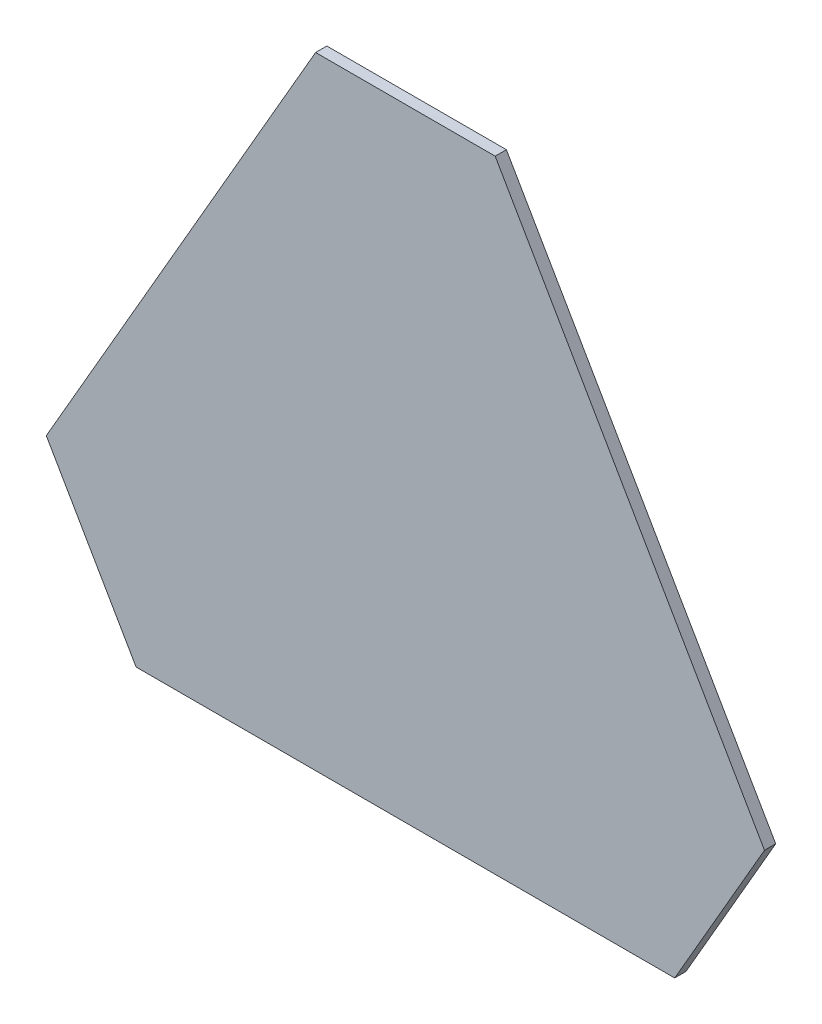
ISO-10303-21;
HEADER;
FILE_DESCRIPTION(('STEP AP214'),'2;1');
FILE_NAME('part.step','',(''),(''),'','','');
FILE_SCHEMA(('AUTOMOTIVE_DESIGN { 1 0 10303 214 1 1 1 1 }'));
ENDSEC;
DATA;
#1=APPLICATION_CONTEXT('core data for automotive mechanical design processes');
#2=APPLICATION_PROTOCOL_DEFINITION('international standard','automotive_design',2000,#1);
#3=PRODUCT_CONTEXT('',#1,'mechanical');
#4=PRODUCT('Part','Part','',(#3));
#5=PRODUCT_RELATED_PRODUCT_CATEGORY('part','',(#4));
#6=PRODUCT_DEFINITION_FORMATION('','',#4);
#7=PRODUCT_DEFINITION_CONTEXT('part definition',#1,'design');
#8=PRODUCT_DEFINITION('design','',#6,#7);
#9=PRODUCT_DEFINITION_SHAPE('','',#8);
#10=(LENGTH_UNIT() NAMED_UNIT(*) SI_UNIT(.MILLI.,.METRE.));
#11=(NAMED_UNIT(*) PLANE_ANGLE_UNIT() SI_UNIT($,.RADIAN.));
#12=(NAMED_UNIT(*) SI_UNIT($,.STERADIAN.) SOLID_ANGLE_UNIT());
#13=UNCERTAINTY_MEASURE_WITH_UNIT(LENGTH_MEASURE(1.E-05),#10,'distance_accuracy_value','');
#14=(GEOMETRIC_REPRESENTATION_CONTEXT(3) GLOBAL_UNCERTAINTY_ASSIGNED_CONTEXT((#13)) GLOBAL_UNIT_ASSIGNED_CONTEXT((#10,
#11,#12)) REPRESENTATION_CONTEXT('',''));
#15=CARTESIAN_POINT('',(0.,0.,0.));
#16=DIRECTION('',(0.,0.,1.));
#17=DIRECTION('',(1.,0.,0.));
#18=AXIS2_PLACEMENT_3D('',#15,#16,#17);
#19=CARTESIAN_POINT('',(-40.,69.2820323027551,5.));
#20=DIRECTION('',(0.866025403784439,0.5,0.));
#21=DIRECTION('',(-0.5,0.866025403784439,0.));
#22=AXIS2_PLACEMENT_3D('',#19,#20,#21);
#23=PLANE('',#22);
#24=DIRECTION('',(0.5,-0.866025403784439,0.));
#25=VECTOR('',#24,1.);
#26=CARTESIAN_POINT('',(-40.,69.2820323027551,0.));
#27=LINE('',#26,#25);
#28=CARTESIAN_POINT('',(-40.,69.2820323027551,0.));
#29=VERTEX_POINT('',#28);
#30=CARTESIAN_POINT('',(0.,0.,0.));
#31=VERTEX_POINT('',#30);
#32=EDGE_CURVE('E130',#29,#31,#27,.T.);
#33=ORIENTED_EDGE('',*,*,#32,.T.);
#34=DIRECTION('',(0.,0.,-1.));
#35=VECTOR('',#34,1.);
#36=CARTESIAN_POINT('',(0.,0.,5.));
#37=LINE('',#36,#35);
#38=CARTESIAN_POINT('',(0.,0.,5.));
#39=VERTEX_POINT('',#38);
#40=EDGE_CURVE('E11',#39,#31,#37,.T.);
#41=ORIENTED_EDGE('',*,*,#40,.F.);
#42=DIRECTION('',(0.5,-0.866025403784439,0.));
#43=VECTOR('',#42,1.);
#44=CARTESIAN_POINT('',(-40.,69.2820323027551,5.));
#45=LINE('',#44,#43);
#46=CARTESIAN_POINT('',(-40.,69.2820323027551,5.));
#47=VERTEX_POINT('',#46);
#48=EDGE_CURVE('E146',#47,#39,#45,.T.);
#49=ORIENTED_EDGE('',*,*,#48,.F.);
#50=DIRECTION('',(0.,0.,-1.));
#51=VECTOR('',#50,1.);
#52=CARTESIAN_POINT('',(-40.,69.2820323027551,5.));
#53=LINE('',#52,#51);
#54=EDGE_CURVE('E126',#47,#29,#53,.T.);
#55=ORIENTED_EDGE('',*,*,#54,.T.);
#56=EDGE_LOOP('',(#33,#41,#49,#55));
#57=FACE_BOUND('',#56,.T.);
#58=ADVANCED_FACE('F40',(#57),#23,.F.);
#59=CARTESIAN_POINT('',(0.,0.,5.));
#60=DIRECTION('',(0.,1.,0.));
#61=DIRECTION('',(0.,0.,1.));
#62=AXIS2_PLACEMENT_3D('',#59,#60,#61);
#63=PLANE('',#62);
#64=DIRECTION('',(1.,0.,0.));
#65=VECTOR('',#64,1.);
#66=CARTESIAN_POINT('',(0.,0.,0.));
#67=LINE('',#66,#65);
#68=CARTESIAN_POINT('',(240.,0.,0.));
#69=VERTEX_POINT('',#68);
#70=EDGE_CURVE('E134',#31,#69,#67,.T.);
#71=ORIENTED_EDGE('',*,*,#70,.T.);
#72=DIRECTION('',(0.,0.,-1.));
#73=VECTOR('',#72,1.);
#74=CARTESIAN_POINT('',(240.,0.,5.));
#75=LINE('',#74,#73);
#76=CARTESIAN_POINT('',(240.,0.,5.));
#77=VERTEX_POINT('',#76);
#78=EDGE_CURVE('E49',#77,#69,#75,.T.);
#79=ORIENTED_EDGE('',*,*,#78,.F.);
#80=DIRECTION('',(1.,0.,0.));
#81=VECTOR('',#80,1.);
#82=CARTESIAN_POINT('',(0.,0.,5.));
#83=LINE('',#82,#81);
#84=EDGE_CURVE('E94',#39,#77,#83,.T.);
#85=ORIENTED_EDGE('',*,*,#84,.F.);
#86=ORIENTED_EDGE('',*,*,#40,.T.);
#87=EDGE_LOOP('',(#71,#79,#85,#86));
#88=FACE_BOUND('',#87,.T.);
#89=ADVANCED_FACE('F175',(#88),#63,.F.);
#90=CARTESIAN_POINT('',(240.,0.,5.));
#91=DIRECTION('',(-0.866025403784438,0.500000000000001,0.));
#92=DIRECTION('',(-0.500000000000001,-0.866025403784438,0.));
#93=AXIS2_PLACEMENT_3D('',#90,#91,#92);
#94=PLANE('',#93);
#95=DIRECTION('',(0.500000000000001,0.866025403784438,0.));
#96=VECTOR('',#95,1.);
#97=CARTESIAN_POINT('',(240.,0.,0.));
#98=LINE('',#97,#96);
#99=CARTESIAN_POINT('',(280.,69.282032302755,0.));
#100=VERTEX_POINT('',#99);
#101=EDGE_CURVE('E137',#69,#100,#98,.T.);
#102=ORIENTED_EDGE('',*,*,#101,.T.);
#103=DIRECTION('',(0.,0.,-1.));
#104=VECTOR('',#103,1.);
#105=CARTESIAN_POINT('',(280.,69.282032302755,5.));
#106=LINE('',#105,#104);
#107=CARTESIAN_POINT('',(280.,69.282032302755,5.));
#108=VERTEX_POINT('',#107);
#109=EDGE_CURVE('E118',#108,#100,#106,.T.);
#110=ORIENTED_EDGE('',*,*,#109,.F.);
#111=DIRECTION('',(0.500000000000001,0.866025403784438,0.));
#112=VECTOR('',#111,1.);
#113=CARTESIAN_POINT('',(240.,0.,5.));
#114=LINE('',#113,#112);
#115=EDGE_CURVE('E107',#77,#108,#114,.T.);
#116=ORIENTED_EDGE('',*,*,#115,.F.);
#117=ORIENTED_EDGE('',*,*,#78,.T.);
#118=EDGE_LOOP('',(#102,#110,#116,#117));
#119=FACE_BOUND('',#118,.T.);
#120=ADVANCED_FACE('F157',(#119),#94,.F.);
#121=CARTESIAN_POINT('',(280.,69.282032302755,5.));
#122=DIRECTION('',(-0.866025403784439,-0.5,0.));
#123=DIRECTION('',(0.5,-0.866025403784439,0.));
#124=AXIS2_PLACEMENT_3D('',#121,#122,#123);
#125=PLANE('',#124);
#126=DIRECTION('',(-0.5,0.866025403784439,0.));
#127=VECTOR('',#126,1.);
#128=CARTESIAN_POINT('',(280.,69.282032302755,0.));
#129=LINE('',#128,#127);
#130=CARTESIAN_POINT('',(160.,277.12812921102,0.));
#131=VERTEX_POINT('',#130);
#132=EDGE_CURVE('E116',#100,#131,#129,.T.);
#133=ORIENTED_EDGE('',*,*,#132,.T.);
#134=DIRECTION('',(0.,0.,-1.));
#135=VECTOR('',#134,1.);
#136=CARTESIAN_POINT('',(160.,277.12812921102,5.));
#137=LINE('',#136,#135);
#138=CARTESIAN_POINT('',(160.,277.12812921102,5.));
#139=VERTEX_POINT('',#138);
#140=EDGE_CURVE('E113',#139,#131,#137,.T.);
#141=ORIENTED_EDGE('',*,*,#140,.F.);
#142=DIRECTION('',(-0.5,0.866025403784439,0.));
#143=VECTOR('',#142,1.);
#144=CARTESIAN_POINT('',(280.,69.282032302755,5.));
#145=LINE('',#144,#143);
#146=EDGE_CURVE('E101',#108,#139,#145,.T.);
#147=ORIENTED_EDGE('',*,*,#146,.F.);
#148=ORIENTED_EDGE('',*,*,#109,.T.);
#149=EDGE_LOOP('',(#133,#141,#147,#148));
#150=FACE_BOUND('',#149,.T.);
#151=ADVANCED_FACE('F114',(#150),#125,.F.);
#152=CARTESIAN_POINT('',(160.,277.12812921102,5.));
#153=DIRECTION('',(0.,-1.,0.));
#154=DIRECTION('',(1.,0.,0.));
#155=AXIS2_PLACEMENT_3D('',#152,#153,#154);
#156=PLANE('',#155);
#157=DIRECTION('',(-1.,0.,0.));
#158=VECTOR('',#157,1.);
#159=CARTESIAN_POINT('',(160.,277.12812921102,0.));
#160=LINE('',#159,#158);
#161=CARTESIAN_POINT('',(80.0000000000001,277.12812921102,0.));
#162=VERTEX_POINT('',#161);
#163=EDGE_CURVE('E80',#131,#162,#160,.T.);
#164=ORIENTED_EDGE('',*,*,#163,.T.);
#165=DIRECTION('',(0.,0.,-1.));
#166=VECTOR('',#165,1.);
#167=CARTESIAN_POINT('',(80.0000000000001,277.12812921102,5.));
#168=LINE('',#167,#166);
#169=CARTESIAN_POINT('',(80.0000000000001,277.12812921102,5.));
#170=VERTEX_POINT('',#169);
#171=EDGE_CURVE('E119',#170,#162,#168,.T.);
#172=ORIENTED_EDGE('',*,*,#171,.F.);
#173=DIRECTION('',(-1.,0.,0.));
#174=VECTOR('',#173,1.);
#175=CARTESIAN_POINT('',(160.,277.12812921102,5.));
#176=LINE('',#175,#174);
#177=EDGE_CURVE('E105',#139,#170,#176,.T.);
#178=ORIENTED_EDGE('',*,*,#177,.F.);
#179=ORIENTED_EDGE('',*,*,#140,.T.);
#180=EDGE_LOOP('',(#164,#172,#178,#179));
#181=FACE_BOUND('',#180,.T.);
#182=ADVANCED_FACE('F121',(#181),#156,.F.);
#183=CARTESIAN_POINT('',(80.0000000000001,277.12812921102,5.));
#184=DIRECTION('',(0.866025403784438,-0.500000000000001,0.));
#185=DIRECTION('',(0.500000000000001,0.866025403784438,0.));
#186=AXIS2_PLACEMENT_3D('',#183,#184,#185);
#187=PLANE('',#186);
#188=DIRECTION('',(-0.500000000000001,-0.866025403784438,0.));
#189=VECTOR('',#188,1.);
#190=CARTESIAN_POINT('',(80.0000000000001,277.12812921102,0.));
#191=LINE('',#190,#189);
#192=EDGE_CURVE('E86',#162,#29,#191,.T.);
#193=ORIENTED_EDGE('',*,*,#192,.T.);
#194=ORIENTED_EDGE('',*,*,#54,.F.);
#195=DIRECTION('',(-0.500000000000001,-0.866025403784438,0.));
#196=VECTOR('',#195,1.);
#197=CARTESIAN_POINT('',(80.0000000000001,277.12812921102,5.));
#198=LINE('',#197,#196);
#199=EDGE_CURVE('E57',#170,#47,#198,.T.);
#200=ORIENTED_EDGE('',*,*,#199,.F.);
#201=ORIENTED_EDGE('',*,*,#171,.T.);
#202=EDGE_LOOP('',(#193,#194,#200,#201));
#203=FACE_BOUND('',#202,.T.);
#204=ADVANCED_FACE('F164',(#203),#187,.F.);
#205=CARTESIAN_POINT('',(0.,0.,5.));
#206=DIRECTION('',(0.,0.,1.));
#207=DIRECTION('',(1.,0.,0.));
#208=AXIS2_PLACEMENT_3D('',#205,#206,#207);
#209=PLANE('',#208);
#210=ORIENTED_EDGE('',*,*,#48,.T.);
#211=ORIENTED_EDGE('',*,*,#84,.T.);
#212=ORIENTED_EDGE('',*,*,#115,.T.);
#213=ORIENTED_EDGE('',*,*,#146,.T.);
#214=ORIENTED_EDGE('',*,*,#177,.T.);
#215=ORIENTED_EDGE('',*,*,#199,.T.);
#216=EDGE_LOOP('',(#210,#211,#212,#213,#214,#215));
#217=FACE_BOUND('',#216,.T.);
#218=ADVANCED_FACE('F103',(#217),#209,.T.);
#219=CARTESIAN_POINT('',(0.,0.,0.));
#220=DIRECTION('',(0.,0.,1.));
#221=DIRECTION('',(1.,0.,0.));
#222=AXIS2_PLACEMENT_3D('',#219,#220,#221);
#223=PLANE('',#222);
#224=ORIENTED_EDGE('',*,*,#32,.F.);
#225=ORIENTED_EDGE('',*,*,#192,.F.);
#226=ORIENTED_EDGE('',*,*,#163,.F.);
#227=ORIENTED_EDGE('',*,*,#132,.F.);
#228=ORIENTED_EDGE('',*,*,#101,.F.);
#229=ORIENTED_EDGE('',*,*,#70,.F.);
#230=EDGE_LOOP('',(#224,#225,#226,#227,#228,#229));
#231=FACE_BOUND('',#230,.T.);
#232=ADVANCED_FACE('F160',(#231),#223,.F.);
#233=CLOSED_SHELL('',(#58,#89,#120,#151,#182,#204,#218,#232));
#234=MANIFOLD_SOLID_BREP('B2',#233);
#235=ADVANCED_BREP_SHAPE_REPRESENTATION('',(#18,#234),#14);
#236=SHAPE_DEFINITION_REPRESENTATION(#9,#235);
ENDSEC;
END-ISO-10303-21;
